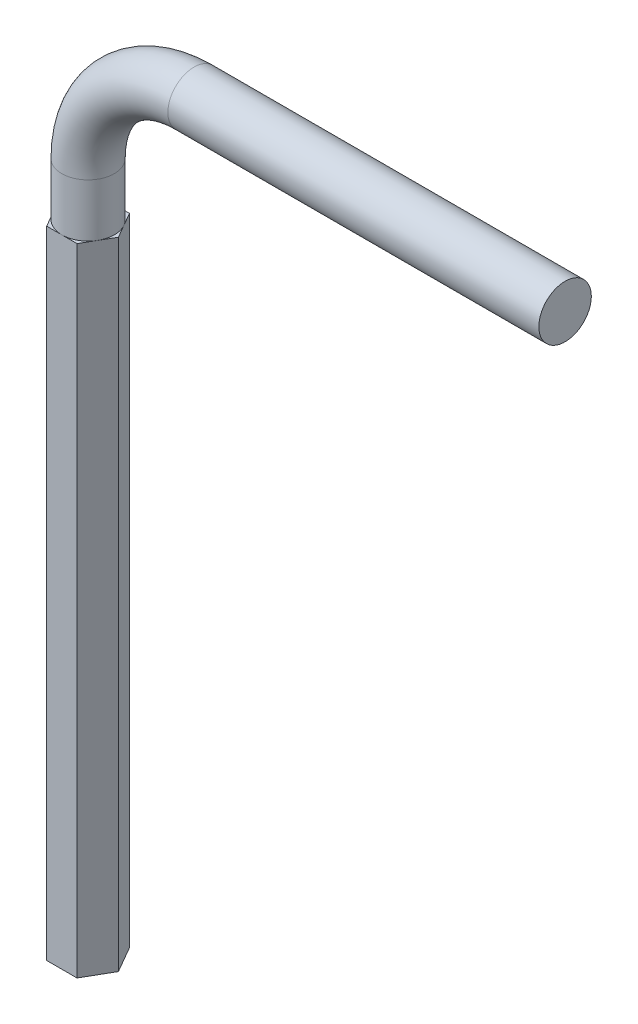
ISO-10303-21;
HEADER;
FILE_DESCRIPTION(('STEP AP214'),'2;1');
FILE_NAME('part.step','',(''),(''),'','','');
FILE_SCHEMA(('AUTOMOTIVE_DESIGN { 1 0 10303 214 1 1 1 1 }'));
ENDSEC;
DATA;
#1=APPLICATION_CONTEXT('core data for automotive mechanical design processes');
#2=APPLICATION_PROTOCOL_DEFINITION('international standard','automotive_design',2000,#1);
#3=PRODUCT_CONTEXT('',#1,'mechanical');
#4=PRODUCT('Part','Part','',(#3));
#5=PRODUCT_RELATED_PRODUCT_CATEGORY('part','',(#4));
#6=PRODUCT_DEFINITION_FORMATION('','',#4);
#7=PRODUCT_DEFINITION_CONTEXT('part definition',#1,'design');
#8=PRODUCT_DEFINITION('design','',#6,#7);
#9=PRODUCT_DEFINITION_SHAPE('','',#8);
#10=(LENGTH_UNIT() NAMED_UNIT(*) SI_UNIT(.MILLI.,.METRE.));
#11=(NAMED_UNIT(*) PLANE_ANGLE_UNIT() SI_UNIT($,.RADIAN.));
#12=(NAMED_UNIT(*) SI_UNIT($,.STERADIAN.) SOLID_ANGLE_UNIT());
#13=UNCERTAINTY_MEASURE_WITH_UNIT(LENGTH_MEASURE(1.E-05),#10,'distance_accuracy_value','');
#14=(GEOMETRIC_REPRESENTATION_CONTEXT(3) GLOBAL_UNCERTAINTY_ASSIGNED_CONTEXT((#13)) GLOBAL_UNIT_ASSIGNED_CONTEXT((#10,
#11,#12)) REPRESENTATION_CONTEXT('',''));
#15=CARTESIAN_POINT('',(0.,0.,0.));
#16=DIRECTION('',(0.,0.,1.));
#17=DIRECTION('',(1.,0.,0.));
#18=AXIS2_PLACEMENT_3D('',#15,#16,#17);
#19=CARTESIAN_POINT('',(45.,75.,0.));
#20=DIRECTION('',(1.,0.,0.));
#21=DIRECTION('',(0.,0.,1.));
#22=AXIS2_PLACEMENT_3D('',#19,#20,#21);
#23=PLANE('',#22);
#24=CARTESIAN_POINT('',(45.,75.,0.));
#25=DIRECTION('',(1.,0.,0.));
#26=DIRECTION('',(0.,0.,1.));
#27=AXIS2_PLACEMENT_3D('',#24,#25,#26);
#28=CIRCLE('',#27,2.475);
#29=CARTESIAN_POINT('',(45.,75.,2.475));
#30=VERTEX_POINT('',#29);
#31=EDGE_CURVE('E153',#30,#30,#28,.T.);
#32=ORIENTED_EDGE('',*,*,#31,.T.);
#33=EDGE_LOOP('',(#32));
#34=FACE_BOUND('',#33,.T.);
#35=ADVANCED_FACE('F39',(#34),#23,.T.);
#36=CARTESIAN_POINT('',(0.,0.,0.));
#37=DIRECTION('',(0.,1.,0.));
#38=DIRECTION('',(0.,0.,1.));
#39=AXIS2_PLACEMENT_3D('',#36,#37,#38);
#40=CYLINDRICAL_SURFACE('',#39,2.475);
#41=CARTESIAN_POINT('',(0.,60.,0.));
#42=DIRECTION('',(0.,1.,0.));
#43=DIRECTION('',(0.,0.,1.));
#44=AXIS2_PLACEMENT_3D('',#41,#42,#43);
#45=CIRCLE('',#44,2.475);
#46=CARTESIAN_POINT('',(0.,60.,2.475));
#47=VERTEX_POINT('',#46);
#48=CARTESIAN_POINT('',(-2.14341287436649,60.,1.2375));
#49=VERTEX_POINT('',#48);
#50=EDGE_CURVE('E11',#47,#49,#45,.F.);
#51=ORIENTED_EDGE('',*,*,#50,.F.);
#52=CARTESIAN_POINT('',(2.14341287436649,60.,1.2375));
#53=VERTEX_POINT('',#52);
#54=EDGE_CURVE('E43',#53,#47,#45,.F.);
#55=ORIENTED_EDGE('',*,*,#54,.F.);
#56=CARTESIAN_POINT('',(2.14341287436649,60.,-1.2375));
#57=VERTEX_POINT('',#56);
#58=EDGE_CURVE('E113',#57,#53,#45,.F.);
#59=ORIENTED_EDGE('',*,*,#58,.F.);
#60=CARTESIAN_POINT('',(0.,60.,-2.475));
#61=VERTEX_POINT('',#60);
#62=EDGE_CURVE('E163',#61,#57,#45,.F.);
#63=ORIENTED_EDGE('',*,*,#62,.F.);
#64=CARTESIAN_POINT('',(-2.14341287436649,60.,-1.2375));
#65=VERTEX_POINT('',#64);
#66=EDGE_CURVE('E59',#65,#61,#45,.F.);
#67=ORIENTED_EDGE('',*,*,#66,.F.);
#68=EDGE_CURVE('E49',#49,#65,#45,.F.);
#69=ORIENTED_EDGE('',*,*,#68,.F.);
#70=EDGE_LOOP('',(#51,#55,#59,#63,#67,#69));
#71=FACE_BOUND('',#70,.T.);
#72=CARTESIAN_POINT('',(0.,64.9999999999999,0.));
#73=DIRECTION('',(0.,1.,0.));
#74=DIRECTION('',(0.,0.,1.));
#75=AXIS2_PLACEMENT_3D('',#72,#73,#74);
#76=CIRCLE('',#75,2.475);
#77=CARTESIAN_POINT('',(-2.475,64.9999999999999,0.));
#78=VERTEX_POINT('',#77);
#79=EDGE_CURVE('E138',#78,#78,#76,.T.);
#80=ORIENTED_EDGE('',*,*,#79,.F.);
#81=EDGE_LOOP('',(#80));
#82=FACE_BOUND('',#81,.T.);
#83=ADVANCED_FACE('F253',(#71,#82),#40,.T.);
#84=CARTESIAN_POINT('',(10.,65.,0.));
#85=DIRECTION('',(0.,0.,-1.));
#86=DIRECTION('',(-1.,0.,0.));
#87=AXIS2_PLACEMENT_3D('',#84,#85,#86);
#88=TOROIDAL_SURFACE('',#87,10.,2.475);
#89=CARTESIAN_POINT('',(10.0000000000001,75.,0.));
#90=DIRECTION('',(1.,0.,0.));
#91=DIRECTION('',(0.,0.,1.));
#92=AXIS2_PLACEMENT_3D('',#89,#90,#91);
#93=CIRCLE('',#92,2.475);
#94=CARTESIAN_POINT('',(10.0000000000001,77.475,0.));
#95=VERTEX_POINT('',#94);
#96=EDGE_CURVE('E144',#95,#95,#93,.T.);
#97=CARTESIAN_POINT('',(10.,65.,0.));
#98=DIRECTION('',(0.,0.,-1.));
#99=DIRECTION('',(-1.,0.,0.));
#100=AXIS2_PLACEMENT_3D('',#97,#98,#99);
#101=CIRCLE('',#100,12.475);
#102=EDGE_CURVE('',#78,#95,#101,.T.);
#103=ORIENTED_EDGE('',*,*,#79,.T.);
#104=ORIENTED_EDGE('',*,*,#96,.F.);
#105=ORIENTED_EDGE('',*,*,#102,.T.);
#106=ORIENTED_EDGE('',*,*,#102,.F.);
#107=EDGE_LOOP('',(#103,#105,#104,#106));
#108=FACE_BOUND('',#107,.T.);
#109=ADVANCED_FACE('F256',(#108),#88,.T.);
#110=CARTESIAN_POINT('',(10.0000000000001,75.,0.));
#111=DIRECTION('',(1.,0.,0.));
#112=DIRECTION('',(0.,0.,-1.));
#113=AXIS2_PLACEMENT_3D('',#110,#111,#112);
#114=CYLINDRICAL_SURFACE('',#113,2.475);
#115=ORIENTED_EDGE('',*,*,#31,.F.);
#116=EDGE_LOOP('',(#115));
#117=FACE_BOUND('',#116,.T.);
#118=ORIENTED_EDGE('',*,*,#96,.T.);
#119=EDGE_LOOP('',(#118));
#120=FACE_BOUND('',#119,.T.);
#121=ADVANCED_FACE('F261',(#117,#120),#114,.T.);
#122=CARTESIAN_POINT('',(1.42894191624432,60.,2.475));
#123=DIRECTION('',(-0.866025403784439,0.,-0.5));
#124=DIRECTION('',(-0.5,0.,0.866025403784439));
#125=AXIS2_PLACEMENT_3D('',#122,#123,#124);
#126=PLANE('',#125);
#127=DIRECTION('',(0.5,0.,-0.866025403784439));
#128=VECTOR('',#127,1.);
#129=CARTESIAN_POINT('',(1.42894191624432,60.,2.475));
#130=LINE('',#129,#128);
#131=CARTESIAN_POINT('',(2.85788383248865,60.,0.));
#132=VERTEX_POINT('',#131);
#133=EDGE_CURVE('E109',#53,#132,#130,.T.);
#134=ORIENTED_EDGE('',*,*,#133,.F.);
#135=CARTESIAN_POINT('',(1.42894191624432,60.,2.475));
#136=VERTEX_POINT('',#135);
#137=EDGE_CURVE('E119',#136,#53,#130,.T.);
#138=ORIENTED_EDGE('',*,*,#137,.F.);
#139=DIRECTION('',(0.,-1.,0.));
#140=VECTOR('',#139,1.);
#141=CARTESIAN_POINT('',(1.42894191624432,60.,2.475));
#142=LINE('',#141,#140);
#143=CARTESIAN_POINT('',(1.42894191624432,0.,2.475));
#144=VERTEX_POINT('',#143);
#145=EDGE_CURVE('E206',#136,#144,#142,.T.);
#146=ORIENTED_EDGE('',*,*,#145,.T.);
#147=DIRECTION('',(0.5,0.,-0.866025403784439));
#148=VECTOR('',#147,1.);
#149=CARTESIAN_POINT('',(1.42894191624432,0.,2.475));
#150=LINE('',#149,#148);
#151=CARTESIAN_POINT('',(2.85788383248865,0.,0.));
#152=VERTEX_POINT('',#151);
#153=EDGE_CURVE('E136',#144,#152,#150,.T.);
#154=ORIENTED_EDGE('',*,*,#153,.T.);
#155=DIRECTION('',(0.,-1.,0.));
#156=VECTOR('',#155,1.);
#157=CARTESIAN_POINT('',(2.85788383248865,60.,0.));
#158=LINE('',#157,#156);
#159=EDGE_CURVE('E127',#132,#152,#158,.T.);
#160=ORIENTED_EDGE('',*,*,#159,.F.);
#161=EDGE_LOOP('',(#134,#138,#146,#154,#160));
#162=FACE_BOUND('',#161,.T.);
#163=ADVANCED_FACE('F134',(#162),#126,.F.);
#164=CARTESIAN_POINT('',(2.85788383248865,60.,0.));
#165=DIRECTION('',(-0.866025403784439,0.,0.5));
#166=DIRECTION('',(0.5,0.,0.866025403784439));
#167=AXIS2_PLACEMENT_3D('',#164,#165,#166);
#168=PLANE('',#167);
#169=DIRECTION('',(-0.5,0.,-0.866025403784439));
#170=VECTOR('',#169,1.);
#171=CARTESIAN_POINT('',(2.85788383248865,60.,0.));
#172=LINE('',#171,#170);
#173=CARTESIAN_POINT('',(1.42894191624432,60.,-2.475));
#174=VERTEX_POINT('',#173);
#175=EDGE_CURVE('E129',#57,#174,#172,.T.);
#176=ORIENTED_EDGE('',*,*,#175,.F.);
#177=EDGE_CURVE('E112',#132,#57,#172,.T.);
#178=ORIENTED_EDGE('',*,*,#177,.F.);
#179=ORIENTED_EDGE('',*,*,#159,.T.);
#180=DIRECTION('',(-0.5,0.,-0.866025403784439));
#181=VECTOR('',#180,1.);
#182=CARTESIAN_POINT('',(2.85788383248865,0.,0.));
#183=LINE('',#182,#181);
#184=CARTESIAN_POINT('',(1.42894191624432,0.,-2.475));
#185=VERTEX_POINT('',#184);
#186=EDGE_CURVE('E209',#152,#185,#183,.T.);
#187=ORIENTED_EDGE('',*,*,#186,.T.);
#188=DIRECTION('',(0.,-1.,0.));
#189=VECTOR('',#188,1.);
#190=CARTESIAN_POINT('',(1.42894191624432,60.,-2.475));
#191=LINE('',#190,#189);
#192=EDGE_CURVE('E139',#174,#185,#191,.T.);
#193=ORIENTED_EDGE('',*,*,#192,.F.);
#194=EDGE_LOOP('',(#176,#178,#179,#187,#193));
#195=FACE_BOUND('',#194,.T.);
#196=ADVANCED_FACE('F125',(#195),#168,.F.);
#197=CARTESIAN_POINT('',(1.42894191624432,60.,-2.475));
#198=DIRECTION('',(0.,0.,1.));
#199=DIRECTION('',(1.,0.,0.));
#200=AXIS2_PLACEMENT_3D('',#197,#198,#199);
#201=PLANE('',#200);
#202=DIRECTION('',(-1.,0.,0.));
#203=VECTOR('',#202,1.);
#204=CARTESIAN_POINT('',(1.42894191624432,60.,-2.475));
#205=LINE('',#204,#203);
#206=CARTESIAN_POINT('',(-1.42894191624433,60.,-2.475));
#207=VERTEX_POINT('',#206);
#208=EDGE_CURVE('E131',#61,#207,#205,.T.);
#209=ORIENTED_EDGE('',*,*,#208,.F.);
#210=EDGE_CURVE('E190',#174,#61,#205,.T.);
#211=ORIENTED_EDGE('',*,*,#210,.F.);
#212=ORIENTED_EDGE('',*,*,#192,.T.);
#213=DIRECTION('',(-1.,0.,0.));
#214=VECTOR('',#213,1.);
#215=CARTESIAN_POINT('',(1.42894191624432,0.,-2.475));
#216=LINE('',#215,#214);
#217=CARTESIAN_POINT('',(-1.42894191624433,0.,-2.475));
#218=VERTEX_POINT('',#217);
#219=EDGE_CURVE('E212',#185,#218,#216,.T.);
#220=ORIENTED_EDGE('',*,*,#219,.T.);
#221=DIRECTION('',(0.,-1.,0.));
#222=VECTOR('',#221,1.);
#223=CARTESIAN_POINT('',(-1.42894191624433,60.,-2.475));
#224=LINE('',#223,#222);
#225=EDGE_CURVE('E147',#207,#218,#224,.T.);
#226=ORIENTED_EDGE('',*,*,#225,.F.);
#227=EDGE_LOOP('',(#209,#211,#212,#220,#226));
#228=FACE_BOUND('',#227,.T.);
#229=ADVANCED_FACE('F235',(#228),#201,.F.);
#230=CARTESIAN_POINT('',(-1.42894191624433,60.,-2.475));
#231=DIRECTION('',(0.866025403784439,0.,0.5));
#232=DIRECTION('',(0.5,0.,-0.866025403784439));
#233=AXIS2_PLACEMENT_3D('',#230,#231,#232);
#234=PLANE('',#233);
#235=DIRECTION('',(-0.5,0.,0.866025403784439));
#236=VECTOR('',#235,1.);
#237=CARTESIAN_POINT('',(-1.42894191624433,60.,-2.475));
#238=LINE('',#237,#236);
#239=CARTESIAN_POINT('',(-2.85788383248865,60.,0.));
#240=VERTEX_POINT('',#239);
#241=EDGE_CURVE('E177',#65,#240,#238,.T.);
#242=ORIENTED_EDGE('',*,*,#241,.F.);
#243=EDGE_CURVE('E185',#207,#65,#238,.T.);
#244=ORIENTED_EDGE('',*,*,#243,.F.);
#245=ORIENTED_EDGE('',*,*,#225,.T.);
#246=DIRECTION('',(-0.5,0.,0.866025403784439));
#247=VECTOR('',#246,1.);
#248=CARTESIAN_POINT('',(-1.42894191624433,0.,-2.475));
#249=LINE('',#248,#247);
#250=CARTESIAN_POINT('',(-2.85788383248865,0.,0.));
#251=VERTEX_POINT('',#250);
#252=EDGE_CURVE('E216',#218,#251,#249,.T.);
#253=ORIENTED_EDGE('',*,*,#252,.T.);
#254=DIRECTION('',(0.,-1.,0.));
#255=VECTOR('',#254,1.);
#256=CARTESIAN_POINT('',(-2.85788383248865,60.,0.));
#257=LINE('',#256,#255);
#258=EDGE_CURVE('E188',#240,#251,#257,.T.);
#259=ORIENTED_EDGE('',*,*,#258,.F.);
#260=EDGE_LOOP('',(#242,#244,#245,#253,#259));
#261=FACE_BOUND('',#260,.T.);
#262=ADVANCED_FACE('F183',(#261),#234,.F.);
#263=CARTESIAN_POINT('',(-2.85788383248865,60.,0.));
#264=DIRECTION('',(0.866025403784439,0.,-0.5));
#265=DIRECTION('',(-0.5,0.,-0.866025403784439));
#266=AXIS2_PLACEMENT_3D('',#263,#264,#265);
#267=PLANE('',#266);
#268=DIRECTION('',(0.5,0.,0.866025403784439));
#269=VECTOR('',#268,1.);
#270=CARTESIAN_POINT('',(-2.85788383248865,60.,0.));
#271=LINE('',#270,#269);
#272=CARTESIAN_POINT('',(-1.42894191624432,60.,2.475));
#273=VERTEX_POINT('',#272);
#274=EDGE_CURVE('E195',#49,#273,#271,.T.);
#275=ORIENTED_EDGE('',*,*,#274,.F.);
#276=EDGE_CURVE('E180',#240,#49,#271,.T.);
#277=ORIENTED_EDGE('',*,*,#276,.F.);
#278=ORIENTED_EDGE('',*,*,#258,.T.);
#279=DIRECTION('',(0.5,0.,0.866025403784439));
#280=VECTOR('',#279,1.);
#281=CARTESIAN_POINT('',(-2.85788383248865,0.,0.));
#282=LINE('',#281,#280);
#283=CARTESIAN_POINT('',(-1.42894191624432,0.,2.475));
#284=VERTEX_POINT('',#283);
#285=EDGE_CURVE('E219',#251,#284,#282,.T.);
#286=ORIENTED_EDGE('',*,*,#285,.T.);
#287=DIRECTION('',(0.,-1.,0.));
#288=VECTOR('',#287,1.);
#289=CARTESIAN_POINT('',(-1.42894191624432,60.,2.475));
#290=LINE('',#289,#288);
#291=EDGE_CURVE('E228',#273,#284,#290,.T.);
#292=ORIENTED_EDGE('',*,*,#291,.F.);
#293=EDGE_LOOP('',(#275,#277,#278,#286,#292));
#294=FACE_BOUND('',#293,.T.);
#295=ADVANCED_FACE('F250',(#294),#267,.F.);
#296=CARTESIAN_POINT('',(-1.42894191624432,60.,2.475));
#297=DIRECTION('',(0.,0.,-1.));
#298=DIRECTION('',(-1.,0.,0.));
#299=AXIS2_PLACEMENT_3D('',#296,#297,#298);
#300=PLANE('',#299);
#301=DIRECTION('',(1.,0.,0.));
#302=VECTOR('',#301,1.);
#303=CARTESIAN_POINT('',(-1.42894191624432,60.,2.475));
#304=LINE('',#303,#302);
#305=EDGE_CURVE('E201',#47,#136,#304,.T.);
#306=ORIENTED_EDGE('',*,*,#305,.F.);
#307=EDGE_CURVE('E202',#273,#47,#304,.T.);
#308=ORIENTED_EDGE('',*,*,#307,.F.);
#309=ORIENTED_EDGE('',*,*,#291,.T.);
#310=DIRECTION('',(1.,0.,0.));
#311=VECTOR('',#310,1.);
#312=CARTESIAN_POINT('',(-1.42894191624432,0.,2.475));
#313=LINE('',#312,#311);
#314=EDGE_CURVE('E120',#284,#144,#313,.T.);
#315=ORIENTED_EDGE('',*,*,#314,.T.);
#316=ORIENTED_EDGE('',*,*,#145,.F.);
#317=EDGE_LOOP('',(#306,#308,#309,#315,#316));
#318=FACE_BOUND('',#317,.T.);
#319=ADVANCED_FACE('F245',(#318),#300,.F.);
#320=CARTESIAN_POINT('',(0.,60.,0.));
#321=DIRECTION('',(0.,1.,0.));
#322=DIRECTION('',(0.,0.,1.));
#323=AXIS2_PLACEMENT_3D('',#320,#321,#322);
#324=PLANE('',#323);
#325=ORIENTED_EDGE('',*,*,#307,.T.);
#326=ORIENTED_EDGE('',*,*,#50,.T.);
#327=ORIENTED_EDGE('',*,*,#274,.T.);
#328=EDGE_LOOP('',(#325,#326,#327));
#329=FACE_BOUND('',#328,.T.);
#330=ADVANCED_FACE('F252',(#329),#324,.T.);
#331=ORIENTED_EDGE('',*,*,#276,.T.);
#332=ORIENTED_EDGE('',*,*,#68,.T.);
#333=ORIENTED_EDGE('',*,*,#241,.T.);
#334=EDGE_LOOP('',(#331,#332,#333));
#335=FACE_BOUND('',#334,.T.);
#336=ADVANCED_FACE('F176',(#335),#324,.T.);
#337=ORIENTED_EDGE('',*,*,#243,.T.);
#338=ORIENTED_EDGE('',*,*,#66,.T.);
#339=ORIENTED_EDGE('',*,*,#208,.T.);
#340=EDGE_LOOP('',(#337,#338,#339));
#341=FACE_BOUND('',#340,.T.);
#342=ADVANCED_FACE('F192',(#341),#324,.T.);
#343=ORIENTED_EDGE('',*,*,#210,.T.);
#344=ORIENTED_EDGE('',*,*,#62,.T.);
#345=ORIENTED_EDGE('',*,*,#175,.T.);
#346=EDGE_LOOP('',(#343,#344,#345));
#347=FACE_BOUND('',#346,.T.);
#348=ADVANCED_FACE('F293',(#347),#324,.T.);
#349=ORIENTED_EDGE('',*,*,#177,.T.);
#350=ORIENTED_EDGE('',*,*,#58,.T.);
#351=ORIENTED_EDGE('',*,*,#133,.T.);
#352=EDGE_LOOP('',(#349,#350,#351));
#353=FACE_BOUND('',#352,.T.);
#354=ADVANCED_FACE('F111',(#353),#324,.T.);
#355=ORIENTED_EDGE('',*,*,#137,.T.);
#356=ORIENTED_EDGE('',*,*,#54,.T.);
#357=ORIENTED_EDGE('',*,*,#305,.T.);
#358=EDGE_LOOP('',(#355,#356,#357));
#359=FACE_BOUND('',#358,.T.);
#360=ADVANCED_FACE('F242',(#359),#324,.T.);
#361=CARTESIAN_POINT('',(0.,0.,0.));
#362=DIRECTION('',(0.,1.,0.));
#363=DIRECTION('',(0.,0.,1.));
#364=AXIS2_PLACEMENT_3D('',#361,#362,#363);
#365=PLANE('',#364);
#366=ORIENTED_EDGE('',*,*,#314,.F.);
#367=ORIENTED_EDGE('',*,*,#285,.F.);
#368=ORIENTED_EDGE('',*,*,#252,.F.);
#369=ORIENTED_EDGE('',*,*,#219,.F.);
#370=ORIENTED_EDGE('',*,*,#186,.F.);
#371=ORIENTED_EDGE('',*,*,#153,.F.);
#372=EDGE_LOOP('',(#366,#367,#368,#369,#370,#371));
#373=FACE_BOUND('',#372,.T.);
#374=ADVANCED_FACE('F41',(#373),#365,.F.);
#375=CLOSED_SHELL('',(#35,#83,#109,#121,#163,#196,#229,#262,#295,#319,#330,#336,#342,#348,#354,
#360,#374));
#376=MANIFOLD_SOLID_BREP('B2',#375);
#377=ADVANCED_BREP_SHAPE_REPRESENTATION('',(#18,#376),#14);
#378=SHAPE_DEFINITION_REPRESENTATION(#9,#377);
ENDSEC;
END-ISO-10303-21;
